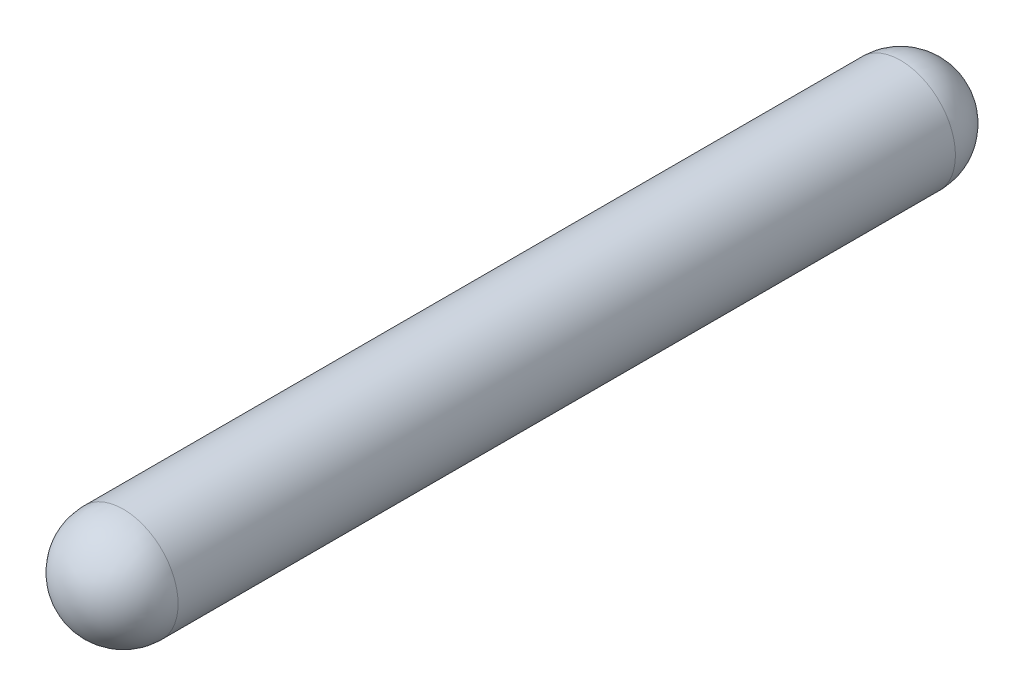
ISO-10303-21;
HEADER;
FILE_DESCRIPTION(('STEP AP214'),'2;1');
FILE_NAME('part.step','',(''),(''),'','','');
FILE_SCHEMA(('AUTOMOTIVE_DESIGN { 1 0 10303 214 1 1 1 1 }'));
ENDSEC;
DATA;
#1=APPLICATION_CONTEXT('core data for automotive mechanical design processes');
#2=APPLICATION_PROTOCOL_DEFINITION('international standard','automotive_design',2000,#1);
#3=PRODUCT_CONTEXT('',#1,'mechanical');
#4=PRODUCT('Part','Part','',(#3));
#5=PRODUCT_RELATED_PRODUCT_CATEGORY('part','',(#4));
#6=PRODUCT_DEFINITION_FORMATION('','',#4);
#7=PRODUCT_DEFINITION_CONTEXT('part definition',#1,'design');
#8=PRODUCT_DEFINITION('design','',#6,#7);
#9=PRODUCT_DEFINITION_SHAPE('','',#8);
#10=(LENGTH_UNIT() NAMED_UNIT(*) SI_UNIT(.MILLI.,.METRE.));
#11=(NAMED_UNIT(*) PLANE_ANGLE_UNIT() SI_UNIT($,.RADIAN.));
#12=(NAMED_UNIT(*) SI_UNIT($,.STERADIAN.) SOLID_ANGLE_UNIT());
#13=UNCERTAINTY_MEASURE_WITH_UNIT(LENGTH_MEASURE(1.E-05),#10,'distance_accuracy_value','');
#14=(GEOMETRIC_REPRESENTATION_CONTEXT(3) GLOBAL_UNCERTAINTY_ASSIGNED_CONTEXT((#13)) GLOBAL_UNIT_ASSIGNED_CONTEXT((#10,
#11,#12)) REPRESENTATION_CONTEXT('',''));
#15=CARTESIAN_POINT('',(0.,0.,0.));
#16=DIRECTION('',(0.,0.,1.));
#17=DIRECTION('',(1.,0.,0.));
#18=AXIS2_PLACEMENT_3D('',#15,#16,#17);
#19=CARTESIAN_POINT('',(2.54,0.,-3.));
#20=DIRECTION('',(1.,0.,0.));
#21=DIRECTION('',(0.,-1.,0.));
#22=AXIS2_PLACEMENT_3D('',#19,#20,#21);
#23=SPHERICAL_SURFACE('',#22,0.458);
#24=CARTESIAN_POINT('',(2.54,0.,-3.));
#25=DIRECTION('',(0.,0.,1.));
#26=DIRECTION('',(1.,0.,0.));
#27=AXIS2_PLACEMENT_3D('',#24,#25,#26);
#28=CIRCLE('',#27,0.458);
#29=CARTESIAN_POINT('',(2.998,0.,-3.));
#30=VERTEX_POINT('',#29);
#31=CARTESIAN_POINT('',(2.082,0.,-3.));
#32=VERTEX_POINT('',#31);
#33=EDGE_CURVE('E42',#30,#32,#28,.T.);
#34=ORIENTED_EDGE('',*,*,#33,.F.);
#35=CARTESIAN_POINT('',(2.54,0.,-3.));
#36=DIRECTION('',(0.,0.,1.));
#37=DIRECTION('',(1.,0.,0.));
#38=AXIS2_PLACEMENT_3D('',#35,#36,#37);
#39=CIRCLE('',#38,0.458);
#40=EDGE_CURVE('E26',#32,#30,#39,.T.);
#41=ORIENTED_EDGE('',*,*,#40,.F.);
#42=EDGE_LOOP('',(#34,#41));
#43=FACE_BOUND('',#42,.T.);
#44=ADVANCED_FACE('F17',(#43),#23,.T.);
#45=CARTESIAN_POINT('',(2.54,0.,3.5));
#46=DIRECTION('',(1.,0.,0.));
#47=DIRECTION('',(0.,1.,0.));
#48=AXIS2_PLACEMENT_3D('',#45,#46,#47);
#49=SPHERICAL_SURFACE('',#48,0.458);
#50=CARTESIAN_POINT('',(2.54,0.,3.5));
#51=DIRECTION('',(0.,0.,1.));
#52=DIRECTION('',(1.,0.,0.));
#53=AXIS2_PLACEMENT_3D('',#50,#51,#52);
#54=CIRCLE('',#53,0.458);
#55=CARTESIAN_POINT('',(2.998,0.,3.5));
#56=VERTEX_POINT('',#55);
#57=CARTESIAN_POINT('',(2.082,0.,3.5));
#58=VERTEX_POINT('',#57);
#59=EDGE_CURVE('E11',#56,#58,#54,.F.);
#60=ORIENTED_EDGE('',*,*,#59,.F.);
#61=CARTESIAN_POINT('',(2.54,0.,3.5));
#62=DIRECTION('',(0.,0.,1.));
#63=DIRECTION('',(1.,0.,0.));
#64=AXIS2_PLACEMENT_3D('',#61,#62,#63);
#65=CIRCLE('',#64,0.458);
#66=EDGE_CURVE('E34',#58,#56,#65,.F.);
#67=ORIENTED_EDGE('',*,*,#66,.F.);
#68=EDGE_LOOP('',(#60,#67));
#69=FACE_BOUND('',#68,.T.);
#70=ADVANCED_FACE('F49',(#69),#49,.T.);
#71=CARTESIAN_POINT('',(2.54,0.,-3.));
#72=DIRECTION('',(0.,0.,1.));
#73=DIRECTION('',(1.,0.,0.));
#74=AXIS2_PLACEMENT_3D('',#71,#72,#73);
#75=CYLINDRICAL_SURFACE('',#74,0.458);
#76=ORIENTED_EDGE('',*,*,#66,.T.);
#77=ORIENTED_EDGE('',*,*,#59,.T.);
#78=EDGE_LOOP('',(#76,#77));
#79=FACE_BOUND('',#78,.T.);
#80=ORIENTED_EDGE('',*,*,#40,.T.);
#81=ORIENTED_EDGE('',*,*,#33,.T.);
#82=EDGE_LOOP('',(#80,#81));
#83=FACE_BOUND('',#82,.T.);
#84=ADVANCED_FACE('F45',(#79,#83),#75,.T.);
#85=CLOSED_SHELL('',(#44,#70,#84));
#86=MANIFOLD_SOLID_BREP('B1',#85);
#87=ADVANCED_BREP_SHAPE_REPRESENTATION('',(#18,#86),#14);
#88=SHAPE_DEFINITION_REPRESENTATION(#9,#87);
ENDSEC;
END-ISO-10303-21;
